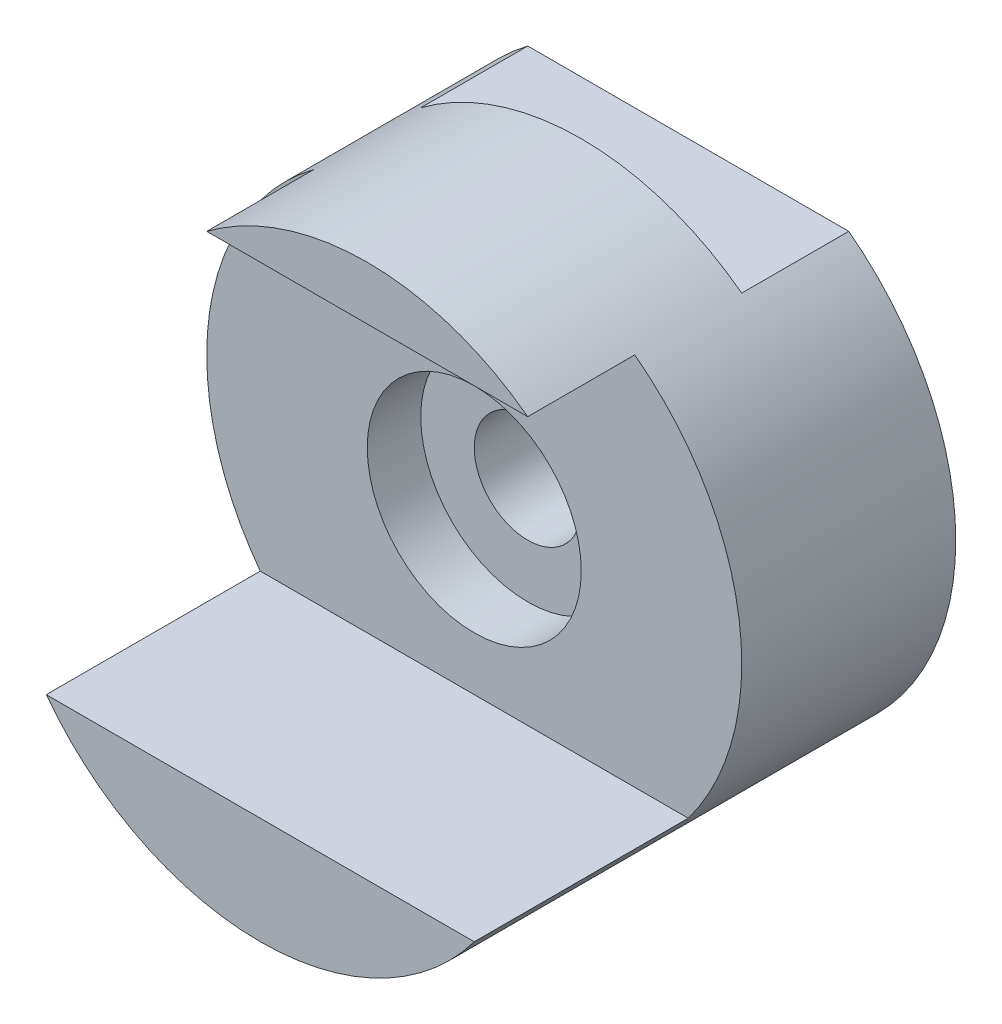
ISO-10303-21;
HEADER;
FILE_DESCRIPTION(('STEP AP214'),'2;1');
FILE_NAME('part.step','',(''),(''),'','','');
FILE_SCHEMA(('AUTOMOTIVE_DESIGN { 1 0 10303 214 1 1 1 1 }'));
ENDSEC;
DATA;
#1=APPLICATION_CONTEXT('core data for automotive mechanical design processes');
#2=APPLICATION_PROTOCOL_DEFINITION('international standard','automotive_design',2000,#1);
#3=PRODUCT_CONTEXT('',#1,'mechanical');
#4=PRODUCT('Part','Part','',(#3));
#5=PRODUCT_RELATED_PRODUCT_CATEGORY('part','',(#4));
#6=PRODUCT_DEFINITION_FORMATION('','',#4);
#7=PRODUCT_DEFINITION_CONTEXT('part definition',#1,'design');
#8=PRODUCT_DEFINITION('design','',#6,#7);
#9=PRODUCT_DEFINITION_SHAPE('','',#8);
#10=(LENGTH_UNIT() NAMED_UNIT(*) SI_UNIT(.MILLI.,.METRE.));
#11=(NAMED_UNIT(*) PLANE_ANGLE_UNIT() SI_UNIT($,.RADIAN.));
#12=(NAMED_UNIT(*) SI_UNIT($,.STERADIAN.) SOLID_ANGLE_UNIT());
#13=UNCERTAINTY_MEASURE_WITH_UNIT(LENGTH_MEASURE(1.E-05),#10,'distance_accuracy_value','');
#14=(GEOMETRIC_REPRESENTATION_CONTEXT(3) GLOBAL_UNCERTAINTY_ASSIGNED_CONTEXT((#13)) GLOBAL_UNIT_ASSIGNED_CONTEXT((#10,
#11,#12)) REPRESENTATION_CONTEXT('',''));
#15=CARTESIAN_POINT('',(0.,0.,0.));
#16=DIRECTION('',(0.,0.,1.));
#17=DIRECTION('',(1.,0.,0.));
#18=AXIS2_PLACEMENT_3D('',#15,#16,#17);
#19=CARTESIAN_POINT('',(0.,0.,8.));
#20=DIRECTION('',(0.,0.,-1.));
#21=DIRECTION('',(-1.,0.,0.));
#22=AXIS2_PLACEMENT_3D('',#19,#20,#21);
#23=CYLINDRICAL_SURFACE('',#22,1.);
#24=CARTESIAN_POINT('',(0.,0.,0.));
#25=DIRECTION('',(0.,0.,1.));
#26=DIRECTION('',(1.,0.,0.));
#27=AXIS2_PLACEMENT_3D('',#24,#25,#26);
#28=CIRCLE('',#27,1.);
#29=CARTESIAN_POINT('',(1.,0.,0.));
#30=VERTEX_POINT('',#29);
#31=EDGE_CURVE('E115',#30,#30,#28,.T.);
#32=ORIENTED_EDGE('',*,*,#31,.F.);
#33=EDGE_LOOP('',(#32));
#34=FACE_BOUND('',#33,.T.);
#35=CARTESIAN_POINT('',(0.,0.,3.));
#36=DIRECTION('',(0.,0.,1.));
#37=DIRECTION('',(1.,0.,0.));
#38=AXIS2_PLACEMENT_3D('',#35,#36,#37);
#39=CIRCLE('',#38,1.);
#40=CARTESIAN_POINT('',(1.,0.,3.));
#41=VERTEX_POINT('',#40);
#42=EDGE_CURVE('E37',#41,#41,#39,.T.);
#43=ORIENTED_EDGE('',*,*,#42,.T.);
#44=EDGE_LOOP('',(#43));
#45=FACE_BOUND('',#44,.T.);
#46=ADVANCED_FACE('F33',(#34,#45),#23,.F.);
#47=CARTESIAN_POINT('',(0.,0.,8.));
#48=DIRECTION('',(0.,0.,1.));
#49=DIRECTION('',(1.,0.,0.));
#50=AXIS2_PLACEMENT_3D('',#47,#48,#49);
#51=PLANE('',#50);
#52=DIRECTION('',(1.,0.,0.));
#53=VECTOR('',#52,1.);
#54=CARTESIAN_POINT('',(-9.,-3.,8.));
#55=LINE('',#54,#53);
#56=CARTESIAN_POINT('',(-4.,-3.,8.));
#57=VERTEX_POINT('',#56);
#58=CARTESIAN_POINT('',(4.,-3.,8.));
#59=VERTEX_POINT('',#58);
#60=EDGE_CURVE('E56',#57,#59,#55,.T.);
#61=ORIENTED_EDGE('',*,*,#60,.F.);
#62=CARTESIAN_POINT('',(0.,0.,8.));
#63=DIRECTION('',(0.,0.,1.));
#64=DIRECTION('',(1.,0.,0.));
#65=AXIS2_PLACEMENT_3D('',#62,#63,#64);
#66=CIRCLE('',#65,5.);
#67=EDGE_CURVE('E106',#57,#59,#66,.T.);
#68=ORIENTED_EDGE('',*,*,#67,.T.);
#69=EDGE_LOOP('',(#61,#68));
#70=FACE_BOUND('',#69,.T.);
#71=ADVANCED_FACE('F171',(#70),#51,.T.);
#72=CARTESIAN_POINT('',(0.,0.,0.));
#73=DIRECTION('',(0.,0.,1.));
#74=DIRECTION('',(1.,0.,0.));
#75=AXIS2_PLACEMENT_3D('',#72,#73,#74);
#76=PLANE('',#75);
#77=CARTESIAN_POINT('',(0.,0.,0.));
#78=DIRECTION('',(0.,0.,1.));
#79=DIRECTION('',(1.,0.,0.));
#80=AXIS2_PLACEMENT_3D('',#77,#78,#79);
#81=CIRCLE('',#80,5.);
#82=CARTESIAN_POINT('',(-3.,4.,0.));
#83=VERTEX_POINT('',#82);
#84=CARTESIAN_POINT('',(3.,4.,0.));
#85=VERTEX_POINT('',#84);
#86=EDGE_CURVE('E109',#83,#85,#81,.T.);
#87=ORIENTED_EDGE('',*,*,#86,.F.);
#88=DIRECTION('',(1.,0.,0.));
#89=VECTOR('',#88,1.);
#90=CARTESIAN_POINT('',(-9.,4.,0.));
#91=LINE('',#90,#89);
#92=EDGE_CURVE('E143',#83,#85,#91,.T.);
#93=ORIENTED_EDGE('',*,*,#92,.T.);
#94=EDGE_LOOP('',(#87,#93));
#95=FACE_BOUND('',#94,.T.);
#96=ORIENTED_EDGE('',*,*,#31,.T.);
#97=EDGE_LOOP('',(#96));
#98=FACE_BOUND('',#97,.T.);
#99=ADVANCED_FACE('F177',(#95,#98),#76,.F.);
#100=CARTESIAN_POINT('',(0.,0.,8.));
#101=DIRECTION('',(0.,0.,-1.));
#102=DIRECTION('',(-1.,0.,0.));
#103=AXIS2_PLACEMENT_3D('',#100,#101,#102);
#104=CYLINDRICAL_SURFACE('',#103,5.);
#105=ORIENTED_EDGE('',*,*,#67,.F.);
#106=DIRECTION('',(0.,0.,-1.));
#107=VECTOR('',#106,1.);
#108=CARTESIAN_POINT('',(-4.,-3.,8.));
#109=LINE('',#108,#107);
#110=CARTESIAN_POINT('',(-4.,-3.,4.));
#111=VERTEX_POINT('',#110);
#112=EDGE_CURVE('E11',#57,#111,#109,.T.);
#113=ORIENTED_EDGE('',*,*,#112,.T.);
#114=CARTESIAN_POINT('',(0.,0.,4.));
#115=DIRECTION('',(0.,0.,-1.));
#116=DIRECTION('',(0.,1.,0.));
#117=AXIS2_PLACEMENT_3D('',#114,#115,#116);
#118=CIRCLE('',#117,5.);
#119=CARTESIAN_POINT('',(-3.,4.,4.));
#120=VERTEX_POINT('',#119);
#121=EDGE_CURVE('E88',#111,#120,#118,.T.);
#122=ORIENTED_EDGE('',*,*,#121,.T.);
#123=DIRECTION('',(0.,0.,-1.));
#124=VECTOR('',#123,1.);
#125=CARTESIAN_POINT('',(-3.,4.,8.));
#126=LINE('',#125,#124);
#127=CARTESIAN_POINT('',(-3.,4.,6.));
#128=VERTEX_POINT('',#127);
#129=EDGE_CURVE('E42',#120,#128,#126,.F.);
#130=ORIENTED_EDGE('',*,*,#129,.T.);
#131=CARTESIAN_POINT('',(0.,0.,6.));
#132=DIRECTION('',(0.,0.,-1.));
#133=DIRECTION('',(-1.,0.,0.));
#134=AXIS2_PLACEMENT_3D('',#131,#132,#133);
#135=CIRCLE('',#134,5.);
#136=CARTESIAN_POINT('',(3.,4.,6.));
#137=VERTEX_POINT('',#136);
#138=EDGE_CURVE('E128',#128,#137,#135,.T.);
#139=ORIENTED_EDGE('',*,*,#138,.T.);
#140=DIRECTION('',(0.,0.,-1.));
#141=VECTOR('',#140,1.);
#142=CARTESIAN_POINT('',(3.,4.,8.));
#143=LINE('',#142,#141);
#144=CARTESIAN_POINT('',(3.,4.,4.));
#145=VERTEX_POINT('',#144);
#146=EDGE_CURVE('E125',#137,#145,#143,.T.);
#147=ORIENTED_EDGE('',*,*,#146,.T.);
#148=CARTESIAN_POINT('',(4.,-3.,4.));
#149=VERTEX_POINT('',#148);
#150=EDGE_CURVE('E97',#145,#149,#118,.T.);
#151=ORIENTED_EDGE('',*,*,#150,.T.);
#152=DIRECTION('',(0.,0.,-1.));
#153=VECTOR('',#152,1.);
#154=CARTESIAN_POINT('',(4.,-3.,8.));
#155=LINE('',#154,#153);
#156=EDGE_CURVE('E101',#149,#59,#155,.F.);
#157=ORIENTED_EDGE('',*,*,#156,.T.);
#158=EDGE_LOOP('',(#105,#113,#122,#130,#139,#147,#151,#157));
#159=FACE_BOUND('',#158,.T.);
#160=ORIENTED_EDGE('',*,*,#86,.T.);
#161=DIRECTION('',(0.,0.,-1.));
#162=VECTOR('',#161,1.);
#163=CARTESIAN_POINT('',(3.,4.,8.));
#164=LINE('',#163,#162);
#165=CARTESIAN_POINT('',(3.,4.,2.));
#166=VERTEX_POINT('',#165);
#167=EDGE_CURVE('E121',#85,#166,#164,.F.);
#168=ORIENTED_EDGE('',*,*,#167,.T.);
#169=CARTESIAN_POINT('',(0.,0.,2.));
#170=DIRECTION('',(0.,0.,1.));
#171=DIRECTION('',(1.,0.,0.));
#172=AXIS2_PLACEMENT_3D('',#169,#170,#171);
#173=CIRCLE('',#172,5.);
#174=CARTESIAN_POINT('',(-3.,4.,2.));
#175=VERTEX_POINT('',#174);
#176=EDGE_CURVE('E108',#166,#175,#173,.T.);
#177=ORIENTED_EDGE('',*,*,#176,.T.);
#178=DIRECTION('',(0.,0.,-1.));
#179=VECTOR('',#178,1.);
#180=CARTESIAN_POINT('',(-3.,4.,8.));
#181=LINE('',#180,#179);
#182=EDGE_CURVE('E112',#175,#83,#181,.T.);
#183=ORIENTED_EDGE('',*,*,#182,.T.);
#184=EDGE_LOOP('',(#160,#168,#177,#183));
#185=FACE_BOUND('',#184,.T.);
#186=ADVANCED_FACE('F35',(#159,#185),#104,.T.);
#187=CARTESIAN_POINT('',(-9.,4.,6.));
#188=DIRECTION('',(0.,0.,-1.));
#189=DIRECTION('',(-1.,0.,0.));
#190=AXIS2_PLACEMENT_3D('',#187,#188,#189);
#191=PLANE('',#190);
#192=DIRECTION('',(1.,0.,0.));
#193=VECTOR('',#192,1.);
#194=CARTESIAN_POINT('',(-9.,4.,6.));
#195=LINE('',#194,#193);
#196=EDGE_CURVE('E98',#128,#137,#195,.T.);
#197=ORIENTED_EDGE('',*,*,#196,.T.);
#198=ORIENTED_EDGE('',*,*,#138,.F.);
#199=EDGE_LOOP('',(#197,#198));
#200=FACE_BOUND('',#199,.T.);
#201=ADVANCED_FACE('F186',(#200),#191,.F.);
#202=CARTESIAN_POINT('',(-9.,4.,4.));
#203=DIRECTION('',(0.,1.,0.));
#204=DIRECTION('',(0.,0.,1.));
#205=AXIS2_PLACEMENT_3D('',#202,#203,#204);
#206=PLANE('',#205);
#207=ORIENTED_EDGE('',*,*,#196,.F.);
#208=ORIENTED_EDGE('',*,*,#129,.F.);
#209=DIRECTION('',(1.,0.,0.));
#210=VECTOR('',#209,1.);
#211=CARTESIAN_POINT('',(-9.,4.,4.));
#212=LINE('',#211,#210);
#213=EDGE_CURVE('E94',#120,#145,#212,.T.);
#214=ORIENTED_EDGE('',*,*,#213,.T.);
#215=ORIENTED_EDGE('',*,*,#146,.F.);
#216=EDGE_LOOP('',(#207,#208,#214,#215));
#217=FACE_BOUND('',#216,.T.);
#218=ADVANCED_FACE('F133',(#217),#206,.F.);
#219=CARTESIAN_POINT('',(-9.,-3.,8.));
#220=DIRECTION('',(0.,-1.,0.));
#221=DIRECTION('',(0.,0.,-1.));
#222=AXIS2_PLACEMENT_3D('',#219,#220,#221);
#223=PLANE('',#222);
#224=ORIENTED_EDGE('',*,*,#60,.T.);
#225=ORIENTED_EDGE('',*,*,#156,.F.);
#226=DIRECTION('',(1.,0.,0.));
#227=VECTOR('',#226,1.);
#228=CARTESIAN_POINT('',(-9.,-3.,4.));
#229=LINE('',#228,#227);
#230=EDGE_CURVE('E91',#111,#149,#229,.T.);
#231=ORIENTED_EDGE('',*,*,#230,.F.);
#232=ORIENTED_EDGE('',*,*,#112,.F.);
#233=EDGE_LOOP('',(#224,#225,#231,#232));
#234=FACE_BOUND('',#233,.T.);
#235=ADVANCED_FACE('F100',(#234),#223,.F.);
#236=CARTESIAN_POINT('',(-9.,-3.,4.));
#237=DIRECTION('',(0.,0.,-1.));
#238=DIRECTION('',(0.,1.,0.));
#239=AXIS2_PLACEMENT_3D('',#236,#237,#238);
#240=PLANE('',#239);
#241=CARTESIAN_POINT('',(0.,0.,4.));
#242=DIRECTION('',(0.,0.,1.));
#243=DIRECTION('',(1.,0.,0.));
#244=AXIS2_PLACEMENT_3D('',#241,#242,#243);
#245=CIRCLE('',#244,2.);
#246=CARTESIAN_POINT('',(2.,0.,4.));
#247=VERTEX_POINT('',#246);
#248=EDGE_CURVE('E139',#247,#247,#245,.T.);
#249=ORIENTED_EDGE('',*,*,#248,.F.);
#250=EDGE_LOOP('',(#249));
#251=FACE_BOUND('',#250,.T.);
#252=ORIENTED_EDGE('',*,*,#213,.F.);
#253=ORIENTED_EDGE('',*,*,#121,.F.);
#254=ORIENTED_EDGE('',*,*,#230,.T.);
#255=ORIENTED_EDGE('',*,*,#150,.F.);
#256=EDGE_LOOP('',(#252,#253,#254,#255));
#257=FACE_BOUND('',#256,.T.);
#258=ADVANCED_FACE('F90',(#251,#257),#240,.F.);
#259=CARTESIAN_POINT('',(-9.,4.,0.));
#260=DIRECTION('',(0.,-1.,0.));
#261=DIRECTION('',(0.,0.,-1.));
#262=AXIS2_PLACEMENT_3D('',#259,#260,#261);
#263=PLANE('',#262);
#264=DIRECTION('',(1.,0.,0.));
#265=VECTOR('',#264,1.);
#266=CARTESIAN_POINT('',(-9.,4.,2.));
#267=LINE('',#266,#265);
#268=EDGE_CURVE('E48',#175,#166,#267,.T.);
#269=ORIENTED_EDGE('',*,*,#268,.T.);
#270=ORIENTED_EDGE('',*,*,#167,.F.);
#271=ORIENTED_EDGE('',*,*,#92,.F.);
#272=ORIENTED_EDGE('',*,*,#182,.F.);
#273=EDGE_LOOP('',(#269,#270,#271,#272));
#274=FACE_BOUND('',#273,.T.);
#275=ADVANCED_FACE('F160',(#274),#263,.F.);
#276=CARTESIAN_POINT('',(-9.,5.,2.));
#277=DIRECTION('',(0.,0.,1.));
#278=DIRECTION('',(1.,0.,0.));
#279=AXIS2_PLACEMENT_3D('',#276,#277,#278);
#280=PLANE('',#279);
#281=ORIENTED_EDGE('',*,*,#268,.F.);
#282=ORIENTED_EDGE('',*,*,#176,.F.);
#283=EDGE_LOOP('',(#281,#282));
#284=FACE_BOUND('',#283,.T.);
#285=ADVANCED_FACE('F166',(#284),#280,.F.);
#286=CARTESIAN_POINT('',(0.,0.,3.));
#287=DIRECTION('',(0.,0.,1.));
#288=DIRECTION('',(1.,0.,0.));
#289=AXIS2_PLACEMENT_3D('',#286,#287,#288);
#290=CYLINDRICAL_SURFACE('',#289,2.);
#291=CARTESIAN_POINT('',(0.,0.,3.));
#292=DIRECTION('',(0.,0.,1.));
#293=DIRECTION('',(1.,0.,0.));
#294=AXIS2_PLACEMENT_3D('',#291,#292,#293);
#295=CIRCLE('',#294,2.);
#296=CARTESIAN_POINT('',(2.,0.,3.));
#297=VERTEX_POINT('',#296);
#298=EDGE_CURVE('E148',#297,#297,#295,.T.);
#299=ORIENTED_EDGE('',*,*,#298,.F.);
#300=EDGE_LOOP('',(#299));
#301=FACE_BOUND('',#300,.T.);
#302=ORIENTED_EDGE('',*,*,#248,.T.);
#303=EDGE_LOOP('',(#302));
#304=FACE_BOUND('',#303,.T.);
#305=ADVANCED_FACE('F157',(#301,#304),#290,.F.);
#306=CARTESIAN_POINT('',(0.,0.,3.));
#307=DIRECTION('',(0.,0.,1.));
#308=DIRECTION('',(1.,0.,0.));
#309=AXIS2_PLACEMENT_3D('',#306,#307,#308);
#310=PLANE('',#309);
#311=ORIENTED_EDGE('',*,*,#42,.F.);
#312=EDGE_LOOP('',(#311));
#313=FACE_BOUND('',#312,.T.);
#314=ORIENTED_EDGE('',*,*,#298,.T.);
#315=EDGE_LOOP('',(#314));
#316=FACE_BOUND('',#315,.T.);
#317=ADVANCED_FACE('F194',(#313,#316),#310,.T.);
#318=CLOSED_SHELL('',(#46,#71,#99,#186,#201,#218,#235,#258,#275,#285,#305,#317));
#319=MANIFOLD_SOLID_BREP('B2',#318);
#320=ADVANCED_BREP_SHAPE_REPRESENTATION('',(#18,#319),#14);
#321=SHAPE_DEFINITION_REPRESENTATION(#9,#320);
ENDSEC;
END-ISO-10303-21;
